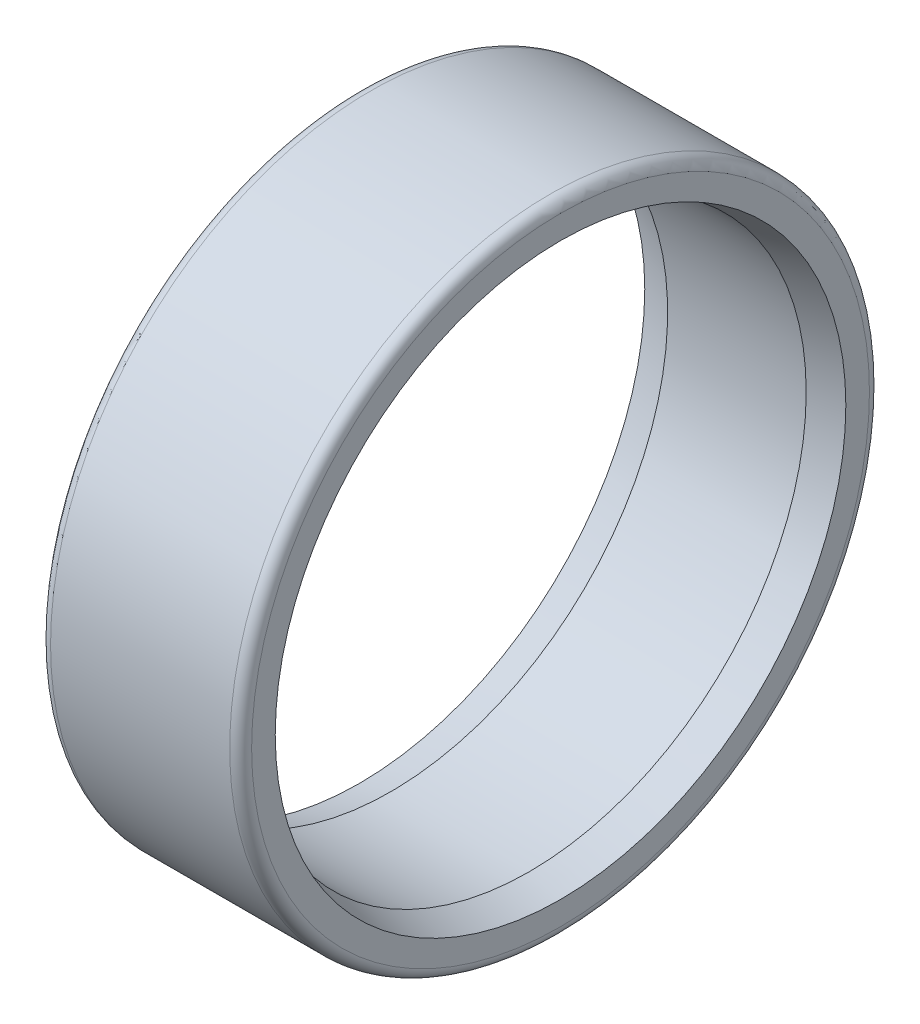
ISO-10303-21;
HEADER;
FILE_DESCRIPTION(('STEP AP214'),'2;1');
FILE_NAME('part.step','',(''),(''),'','','');
FILE_SCHEMA(('AUTOMOTIVE_DESIGN { 1 0 10303 214 1 1 1 1 }'));
ENDSEC;
DATA;
#1=APPLICATION_CONTEXT('core data for automotive mechanical design processes');
#2=APPLICATION_PROTOCOL_DEFINITION('international standard','automotive_design',2000,#1);
#3=PRODUCT_CONTEXT('',#1,'mechanical');
#4=PRODUCT('Part','Part','',(#3));
#5=PRODUCT_RELATED_PRODUCT_CATEGORY('part','',(#4));
#6=PRODUCT_DEFINITION_FORMATION('','',#4);
#7=PRODUCT_DEFINITION_CONTEXT('part definition',#1,'design');
#8=PRODUCT_DEFINITION('design','',#6,#7);
#9=PRODUCT_DEFINITION_SHAPE('','',#8);
#10=(LENGTH_UNIT() NAMED_UNIT(*) SI_UNIT(.MILLI.,.METRE.));
#11=(NAMED_UNIT(*) PLANE_ANGLE_UNIT() SI_UNIT($,.RADIAN.));
#12=(NAMED_UNIT(*) SI_UNIT($,.STERADIAN.) SOLID_ANGLE_UNIT());
#13=UNCERTAINTY_MEASURE_WITH_UNIT(LENGTH_MEASURE(1.E-05),#10,'distance_accuracy_value','');
#14=(GEOMETRIC_REPRESENTATION_CONTEXT(3) GLOBAL_UNCERTAINTY_ASSIGNED_CONTEXT((#13)) GLOBAL_UNIT_ASSIGNED_CONTEXT((#10,
#11,#12)) REPRESENTATION_CONTEXT('',''));
#15=CARTESIAN_POINT('',(0.,0.,0.));
#16=DIRECTION('',(0.,0.,1.));
#17=DIRECTION('',(1.,0.,0.));
#18=AXIS2_PLACEMENT_3D('',#15,#16,#17);
#19=CARTESIAN_POINT('',(1.71,0.,0.));
#20=DIRECTION('',(1.,0.,0.));
#21=DIRECTION('',(0.,0.,-1.));
#22=AXIS2_PLACEMENT_3D('',#19,#20,#21);
#23=CYLINDRICAL_SURFACE('',#22,15.15);
#24=CARTESIAN_POINT('',(1.71,0.,0.));
#25=DIRECTION('',(-1.,0.,0.));
#26=DIRECTION('',(0.,0.,1.));
#27=AXIS2_PLACEMENT_3D('',#24,#25,#26);
#28=CIRCLE('',#27,15.15);
#29=CARTESIAN_POINT('',(1.70999999999999,0.,15.15));
#30=VERTEX_POINT('',#29);
#31=EDGE_CURVE('E110',#30,#30,#28,.F.);
#32=ORIENTED_EDGE('',*,*,#31,.F.);
#33=EDGE_LOOP('',(#32));
#34=FACE_BOUND('',#33,.T.);
#35=CARTESIAN_POINT('',(9.28999999999999,0.,0.));
#36=DIRECTION('',(1.,0.,0.));
#37=DIRECTION('',(0.,0.,1.));
#38=AXIS2_PLACEMENT_3D('',#35,#36,#37);
#39=CIRCLE('',#38,15.15);
#40=CARTESIAN_POINT('',(9.29,0.,15.15));
#41=VERTEX_POINT('',#40);
#42=EDGE_CURVE('E108',#41,#41,#39,.F.);
#43=ORIENTED_EDGE('',*,*,#42,.F.);
#44=EDGE_LOOP('',(#43));
#45=FACE_BOUND('',#44,.T.);
#46=ADVANCED_FACE('F14',(#34,#45),#23,.F.);
#47=CARTESIAN_POINT('',(1.70999999999999,0.,0.));
#48=DIRECTION('',(-1.,0.,0.));
#49=DIRECTION('',(0.,0.,1.));
#50=AXIS2_PLACEMENT_3D('',#47,#48,#49);
#51=CONICAL_SURFACE('',#50,15.15,0.261799387799148);
#52=CARTESIAN_POINT('',(0.,0.,0.));
#53=DIRECTION('',(-1.,0.,0.));
#54=DIRECTION('',(0.,0.,1.));
#55=AXIS2_PLACEMENT_3D('',#52,#53,#54);
#56=CIRCLE('',#55,15.6081931190572);
#57=CARTESIAN_POINT('',(0.,0.,15.6081931190572));
#58=VERTEX_POINT('',#57);
#59=EDGE_CURVE('E17',#58,#58,#56,.F.);
#60=ORIENTED_EDGE('',*,*,#59,.F.);
#61=EDGE_LOOP('',(#60));
#62=FACE_BOUND('',#61,.T.);
#63=ORIENTED_EDGE('',*,*,#31,.T.);
#64=EDGE_LOOP('',(#63));
#65=FACE_BOUND('',#64,.T.);
#66=ADVANCED_FACE('F80',(#62,#65),#51,.F.);
#67=CARTESIAN_POINT('',(9.29,0.,0.));
#68=DIRECTION('',(1.,0.,0.));
#69=DIRECTION('',(0.,0.,-1.));
#70=AXIS2_PLACEMENT_3D('',#67,#68,#69);
#71=CONICAL_SURFACE('',#70,15.15,0.26179938779915);
#72=ORIENTED_EDGE('',*,*,#42,.T.);
#73=EDGE_LOOP('',(#72));
#74=FACE_BOUND('',#73,.T.);
#75=CARTESIAN_POINT('',(11.,0.,0.));
#76=DIRECTION('',(1.,0.,0.));
#77=DIRECTION('',(0.,0.,-1.));
#78=AXIS2_PLACEMENT_3D('',#75,#76,#77);
#79=CIRCLE('',#78,15.6081931190572);
#80=CARTESIAN_POINT('',(11.,0.,-15.6081931190572));
#81=VERTEX_POINT('',#80);
#82=EDGE_CURVE('E103',#81,#81,#79,.F.);
#83=ORIENTED_EDGE('',*,*,#82,.F.);
#84=EDGE_LOOP('',(#83));
#85=FACE_BOUND('',#84,.T.);
#86=ADVANCED_FACE('F76',(#74,#85),#71,.F.);
#87=CARTESIAN_POINT('',(0.,0.,16.2540965595286));
#88=DIRECTION('',(-1.,0.,0.));
#89=DIRECTION('',(0.,0.,1.));
#90=AXIS2_PLACEMENT_3D('',#87,#88,#89);
#91=PLANE('',#90);
#92=ORIENTED_EDGE('',*,*,#59,.T.);
#93=EDGE_LOOP('',(#92));
#94=FACE_BOUND('',#93,.T.);
#95=CARTESIAN_POINT('',(0.,0.,0.));
#96=DIRECTION('',(1.,0.,0.));
#97=DIRECTION('',(0.,0.,1.));
#98=AXIS2_PLACEMENT_3D('',#95,#96,#97);
#99=CIRCLE('',#98,16.9);
#100=CARTESIAN_POINT('',(0.,0.,16.9));
#101=VERTEX_POINT('',#100);
#102=EDGE_CURVE('E60',#101,#101,#99,.T.);
#103=ORIENTED_EDGE('',*,*,#102,.F.);
#104=EDGE_LOOP('',(#103));
#105=FACE_BOUND('',#104,.T.);
#106=ADVANCED_FACE('F66',(#94,#105),#91,.T.);
#107=CARTESIAN_POINT('',(11.,0.,16.2540965595286));
#108=DIRECTION('',(1.,0.,0.));
#109=DIRECTION('',(0.,0.,-1.));
#110=AXIS2_PLACEMENT_3D('',#107,#108,#109);
#111=PLANE('',#110);
#112=CARTESIAN_POINT('',(11.,0.,0.));
#113=DIRECTION('',(-1.,0.,0.));
#114=DIRECTION('',(0.,0.,1.));
#115=AXIS2_PLACEMENT_3D('',#112,#113,#114);
#116=CIRCLE('',#115,16.9);
#117=CARTESIAN_POINT('',(11.,0.,16.9));
#118=VERTEX_POINT('',#117);
#119=EDGE_CURVE('E26',#118,#118,#116,.T.);
#120=ORIENTED_EDGE('',*,*,#119,.F.);
#121=EDGE_LOOP('',(#120));
#122=FACE_BOUND('',#121,.T.);
#123=ORIENTED_EDGE('',*,*,#82,.T.);
#124=EDGE_LOOP('',(#123));
#125=FACE_BOUND('',#124,.T.);
#126=ADVANCED_FACE('F75',(#122,#125),#111,.T.);
#127=CARTESIAN_POINT('',(0.599999999999998,0.,0.));
#128=DIRECTION('',(1.,0.,0.));
#129=DIRECTION('',(0.,1.,0.));
#130=AXIS2_PLACEMENT_3D('',#127,#128,#129);
#131=TOROIDAL_SURFACE('',#130,16.9,0.599999999999998);
#132=ORIENTED_EDGE('',*,*,#102,.T.);
#133=EDGE_LOOP('',(#132));
#134=FACE_BOUND('',#133,.T.);
#135=CARTESIAN_POINT('',(0.6,0.,0.));
#136=DIRECTION('',(1.,0.,0.));
#137=DIRECTION('',(0.,0.,-1.));
#138=AXIS2_PLACEMENT_3D('',#135,#136,#137);
#139=CIRCLE('',#138,17.5);
#140=CARTESIAN_POINT('',(0.6,0.,-17.5));
#141=VERTEX_POINT('',#140);
#142=EDGE_CURVE('E21',#141,#141,#139,.T.);
#143=ORIENTED_EDGE('',*,*,#142,.F.);
#144=EDGE_LOOP('',(#143));
#145=FACE_BOUND('',#144,.T.);
#146=ADVANCED_FACE('F40',(#134,#145),#131,.T.);
#147=CARTESIAN_POINT('',(10.4,0.,0.));
#148=DIRECTION('',(1.,0.,0.));
#149=DIRECTION('',(0.,1.,0.));
#150=AXIS2_PLACEMENT_3D('',#147,#148,#149);
#151=TOROIDAL_SURFACE('',#150,16.9,0.600000000000001);
#152=CARTESIAN_POINT('',(10.4,0.,0.));
#153=DIRECTION('',(1.,0.,0.));
#154=DIRECTION('',(0.,0.,-1.));
#155=AXIS2_PLACEMENT_3D('',#152,#153,#154);
#156=CIRCLE('',#155,17.5);
#157=CARTESIAN_POINT('',(10.4,0.,-17.5));
#158=VERTEX_POINT('',#157);
#159=EDGE_CURVE('E10',#158,#158,#156,.F.);
#160=ORIENTED_EDGE('',*,*,#159,.F.);
#161=EDGE_LOOP('',(#160));
#162=FACE_BOUND('',#161,.T.);
#163=ORIENTED_EDGE('',*,*,#119,.T.);
#164=EDGE_LOOP('',(#163));
#165=FACE_BOUND('',#164,.T.);
#166=ADVANCED_FACE('F34',(#162,#165),#151,.T.);
#167=CARTESIAN_POINT('',(5.5,0.,0.));
#168=DIRECTION('',(1.,0.,0.));
#169=DIRECTION('',(0.,0.,-1.));
#170=AXIS2_PLACEMENT_3D('',#167,#168,#169);
#171=CYLINDRICAL_SURFACE('',#170,17.5);
#172=ORIENTED_EDGE('',*,*,#142,.T.);
#173=EDGE_LOOP('',(#172));
#174=FACE_BOUND('',#173,.T.);
#175=ORIENTED_EDGE('',*,*,#159,.T.);
#176=EDGE_LOOP('',(#175));
#177=FACE_BOUND('',#176,.T.);
#178=ADVANCED_FACE('F39',(#174,#177),#171,.T.);
#179=CLOSED_SHELL('',(#46,#66,#86,#106,#126,#146,#166,#178));
#180=MANIFOLD_SOLID_BREP('B1',#179);
#181=ADVANCED_BREP_SHAPE_REPRESENTATION('',(#18,#180),#14);
#182=SHAPE_DEFINITION_REPRESENTATION(#9,#181);
ENDSEC;
END-ISO-10303-21;
